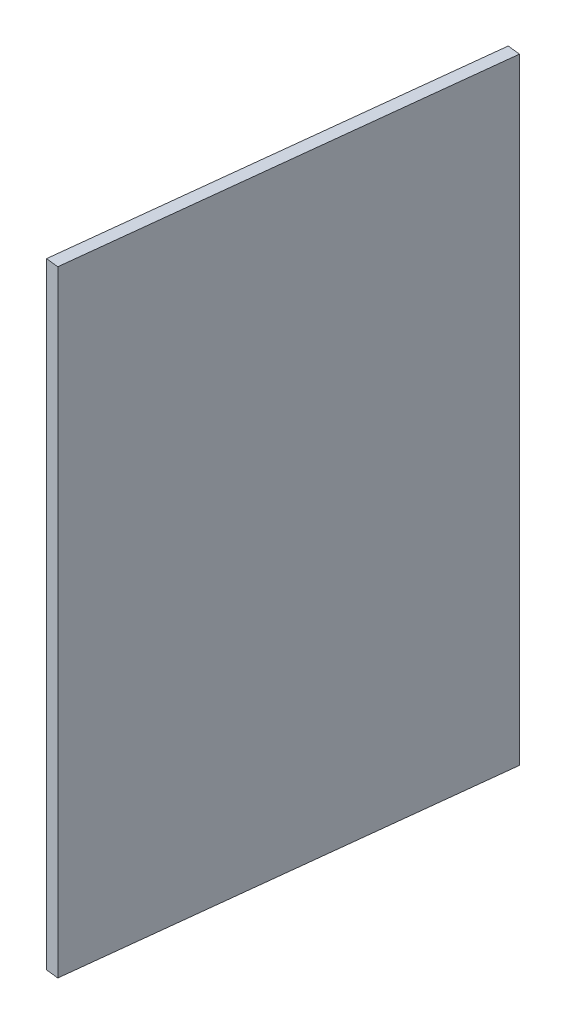
ISO-10303-21;
HEADER;
FILE_DESCRIPTION(('STEP AP214'),'2;1');
FILE_NAME('part.step','',(''),(''),'','','');
FILE_SCHEMA(('AUTOMOTIVE_DESIGN { 1 0 10303 214 1 1 1 1 }'));
ENDSEC;
DATA;
#1=APPLICATION_CONTEXT('core data for automotive mechanical design processes');
#2=APPLICATION_PROTOCOL_DEFINITION('international standard','automotive_design',2000,#1);
#3=PRODUCT_CONTEXT('',#1,'mechanical');
#4=PRODUCT('Part','Part','',(#3));
#5=PRODUCT_RELATED_PRODUCT_CATEGORY('part','',(#4));
#6=PRODUCT_DEFINITION_FORMATION('','',#4);
#7=PRODUCT_DEFINITION_CONTEXT('part definition',#1,'design');
#8=PRODUCT_DEFINITION('design','',#6,#7);
#9=PRODUCT_DEFINITION_SHAPE('','',#8);
#10=(LENGTH_UNIT() NAMED_UNIT(*) SI_UNIT(.MILLI.,.METRE.));
#11=(NAMED_UNIT(*) PLANE_ANGLE_UNIT() SI_UNIT($,.RADIAN.));
#12=(NAMED_UNIT(*) SI_UNIT($,.STERADIAN.) SOLID_ANGLE_UNIT());
#13=UNCERTAINTY_MEASURE_WITH_UNIT(LENGTH_MEASURE(1.E-05),#10,'distance_accuracy_value','');
#14=(GEOMETRIC_REPRESENTATION_CONTEXT(3) GLOBAL_UNCERTAINTY_ASSIGNED_CONTEXT((#13)) GLOBAL_UNIT_ASSIGNED_CONTEXT((#10,
#11,#12)) REPRESENTATION_CONTEXT('',''));
#15=CARTESIAN_POINT('',(0.,0.,0.));
#16=DIRECTION('',(0.,0.,1.));
#17=DIRECTION('',(1.,0.,0.));
#18=AXIS2_PLACEMENT_3D('',#15,#16,#17);
#19=CARTESIAN_POINT('',(8.87442397833839,0.,67.6658333209263));
#20=DIRECTION('',(-0.993723873054748,0.,-0.111860914179488));
#21=DIRECTION('',(-0.111860914179488,0.,0.993723873054748));
#22=AXIS2_PLACEMENT_3D('',#19,#20,#21);
#23=PLANE('',#22);
#24=DIRECTION('',(0.,1.,0.));
#25=VECTOR('',#24,1.);
#26=CARTESIAN_POINT('',(7.47616255109471,-18.4375000000002,80.0873817341106));
#27=LINE('',#26,#25);
#28=CARTESIAN_POINT('',(7.47616255109476,18.4375000000001,80.0873817341105));
#29=VERTEX_POINT('',#28);
#30=CARTESIAN_POINT('',(7.47616255109476,-18.4375000000002,80.0873817341105));
#31=VERTEX_POINT('',#30);
#32=EDGE_CURVE('E58',#29,#31,#27,.F.);
#33=ORIENTED_EDGE('',*,*,#32,.F.);
#34=DIRECTION('',(-0.11186091417949,0.,0.993723873054748));
#35=VECTOR('',#34,1.);
#36=CARTESIAN_POINT('',(10.272685405582,18.4375000000001,55.2442849077418));
#37=LINE('',#36,#35);
#38=CARTESIAN_POINT('',(10.272685405582,18.4375000000001,55.2442849077418));
#39=VERTEX_POINT('',#38);
#40=EDGE_CURVE('E53',#39,#29,#37,.T.);
#41=ORIENTED_EDGE('',*,*,#40,.F.);
#42=DIRECTION('',(0.,1.,0.));
#43=VECTOR('',#42,1.);
#44=CARTESIAN_POINT('',(10.272685405582,18.4375000000001,55.2442849077417));
#45=LINE('',#44,#43);
#46=CARTESIAN_POINT('',(10.272685405582,-18.4375000000002,55.2442849077418));
#47=VERTEX_POINT('',#46);
#48=EDGE_CURVE('E68',#47,#39,#45,.T.);
#49=ORIENTED_EDGE('',*,*,#48,.F.);
#50=DIRECTION('',(0.11186091417949,0.,-0.993723873054748));
#51=VECTOR('',#50,1.);
#52=CARTESIAN_POINT('',(7.47616255109473,-18.4375000000002,80.0873817341105));
#53=LINE('',#52,#51);
#54=EDGE_CURVE('E20',#31,#47,#53,.T.);
#55=ORIENTED_EDGE('',*,*,#54,.F.);
#56=EDGE_LOOP('',(#33,#41,#49,#55));
#57=FACE_BOUND('',#56,.T.);
#58=ADVANCED_FACE('F17',(#57),#23,.T.);
#59=CARTESIAN_POINT('',(11.0299029968497,-18.4375000000002,55.3295229243465));
#60=DIRECTION('',(0.,-1.,0.));
#61=DIRECTION('',(0.,0.,-1.));
#62=AXIS2_PLACEMENT_3D('',#59,#60,#61);
#63=PLANE('',#62);
#64=ORIENTED_EDGE('',*,*,#54,.T.);
#65=DIRECTION('',(-0.993723873054748,0.,-0.111860914179488));
#66=VECTOR('',#65,1.);
#67=CARTESIAN_POINT('',(11.0299029968497,-18.4375000000002,55.3295229243465));
#68=LINE('',#67,#66);
#69=CARTESIAN_POINT('',(11.0299029968497,-18.4375000000002,55.3295229243465));
#70=VERTEX_POINT('',#69);
#71=EDGE_CURVE('E79',#70,#47,#68,.T.);
#72=ORIENTED_EDGE('',*,*,#71,.F.);
#73=DIRECTION('',(-0.111860914179491,0.,0.993723873054748));
#74=VECTOR('',#73,1.);
#75=CARTESIAN_POINT('',(9.63164156960607,-18.4375000000002,67.7510713375309));
#76=LINE('',#75,#74);
#77=CARTESIAN_POINT('',(8.23338014236243,-18.4375000000002,80.1726197507154));
#78=VERTEX_POINT('',#77);
#79=EDGE_CURVE('E74',#70,#78,#76,.T.);
#80=ORIENTED_EDGE('',*,*,#79,.T.);
#81=DIRECTION('',(0.993723873054748,0.,0.111860914179488));
#82=VECTOR('',#81,1.);
#83=CARTESIAN_POINT('',(8.23338014236243,-18.4375000000002,80.1726197507154));
#84=LINE('',#83,#82);
#85=EDGE_CURVE('E63',#31,#78,#84,.T.);
#86=ORIENTED_EDGE('',*,*,#85,.F.);
#87=EDGE_LOOP('',(#64,#72,#80,#86));
#88=FACE_BOUND('',#87,.T.);
#89=ADVANCED_FACE('F73',(#88),#63,.T.);
#90=CARTESIAN_POINT('',(8.23338014236243,-18.4375000000002,80.1726197507154));
#91=DIRECTION('',(-0.111860914179488,0.,0.993723873054748));
#92=DIRECTION('',(0.993723873054748,0.,0.111860914179488));
#93=AXIS2_PLACEMENT_3D('',#90,#91,#92);
#94=PLANE('',#93);
#95=ORIENTED_EDGE('',*,*,#32,.T.);
#96=ORIENTED_EDGE('',*,*,#85,.T.);
#97=DIRECTION('',(0.,1.,0.));
#98=VECTOR('',#97,1.);
#99=CARTESIAN_POINT('',(8.23338014236242,0.,80.1726197507154));
#100=LINE('',#99,#98);
#101=CARTESIAN_POINT('',(8.23338014236243,18.4375000000001,80.1726197507154));
#102=VERTEX_POINT('',#101);
#103=EDGE_CURVE('E84',#78,#102,#100,.T.);
#104=ORIENTED_EDGE('',*,*,#103,.T.);
#105=DIRECTION('',(0.993723873054729,0.,0.111860914179658));
#106=VECTOR('',#105,1.);
#107=CARTESIAN_POINT('',(7.47616255109473,18.4375000000001,80.0873817341105));
#108=LINE('',#107,#106);
#109=EDGE_CURVE('E65',#29,#102,#108,.T.);
#110=ORIENTED_EDGE('',*,*,#109,.F.);
#111=EDGE_LOOP('',(#95,#96,#104,#110));
#112=FACE_BOUND('',#111,.T.);
#113=ADVANCED_FACE('F60',(#112),#94,.T.);
#114=CARTESIAN_POINT('',(8.23338014236243,18.4375000000001,80.1726197507154));
#115=DIRECTION('',(0.,1.,0.));
#116=DIRECTION('',(0.,0.,1.));
#117=AXIS2_PLACEMENT_3D('',#114,#115,#116);
#118=PLANE('',#117);
#119=ORIENTED_EDGE('',*,*,#40,.T.);
#120=ORIENTED_EDGE('',*,*,#109,.T.);
#121=DIRECTION('',(-0.111860914179491,0.,0.993723873054748));
#122=VECTOR('',#121,1.);
#123=CARTESIAN_POINT('',(9.63164156960607,18.4375000000001,67.7510713375309));
#124=LINE('',#123,#122);
#125=CARTESIAN_POINT('',(11.0299029968497,18.4375000000001,55.3295229243465));
#126=VERTEX_POINT('',#125);
#127=EDGE_CURVE('E26',#102,#126,#124,.F.);
#128=ORIENTED_EDGE('',*,*,#127,.T.);
#129=DIRECTION('',(-0.993723873054748,0.,-0.111860914179488));
#130=VECTOR('',#129,1.);
#131=CARTESIAN_POINT('',(11.0299029968497,18.4375000000001,55.3295229243465));
#132=LINE('',#131,#130);
#133=EDGE_CURVE('E34',#39,#126,#132,.F.);
#134=ORIENTED_EDGE('',*,*,#133,.F.);
#135=EDGE_LOOP('',(#119,#120,#128,#134));
#136=FACE_BOUND('',#135,.T.);
#137=ADVANCED_FACE('F88',(#136),#118,.T.);
#138=CARTESIAN_POINT('',(11.0299029968497,18.4375000000001,55.3295229243465));
#139=DIRECTION('',(0.111860914179488,0.,-0.993723873054748));
#140=DIRECTION('',(-0.993723873054748,0.,-0.111860914179488));
#141=AXIS2_PLACEMENT_3D('',#138,#139,#140);
#142=PLANE('',#141);
#143=ORIENTED_EDGE('',*,*,#48,.T.);
#144=ORIENTED_EDGE('',*,*,#133,.T.);
#145=DIRECTION('',(0.,1.,0.));
#146=VECTOR('',#145,1.);
#147=CARTESIAN_POINT('',(11.0299029968497,0.,55.3295229243465));
#148=LINE('',#147,#146);
#149=EDGE_CURVE('E11',#126,#70,#148,.F.);
#150=ORIENTED_EDGE('',*,*,#149,.T.);
#151=ORIENTED_EDGE('',*,*,#71,.T.);
#152=EDGE_LOOP('',(#143,#144,#150,#151));
#153=FACE_BOUND('',#152,.T.);
#154=ADVANCED_FACE('F91',(#153),#142,.T.);
#155=CARTESIAN_POINT('',(9.63164156960607,0.,67.7510713375309));
#156=DIRECTION('',(-0.993723873054748,0.,-0.111860914179491));
#157=DIRECTION('',(-0.111860914179491,0.,0.993723873054748));
#158=AXIS2_PLACEMENT_3D('',#155,#156,#157);
#159=PLANE('',#158);
#160=ORIENTED_EDGE('',*,*,#127,.F.);
#161=ORIENTED_EDGE('',*,*,#103,.F.);
#162=ORIENTED_EDGE('',*,*,#79,.F.);
#163=ORIENTED_EDGE('',*,*,#149,.F.);
#164=EDGE_LOOP('',(#160,#161,#162,#163));
#165=FACE_BOUND('',#164,.T.);
#166=ADVANCED_FACE('F90',(#165),#159,.F.);
#167=CLOSED_SHELL('',(#58,#89,#113,#137,#154,#166));
#168=MANIFOLD_SOLID_BREP('B1',#167);
#169=ADVANCED_BREP_SHAPE_REPRESENTATION('',(#18,#168),#14);
#170=SHAPE_DEFINITION_REPRESENTATION(#9,#169);
ENDSEC;
END-ISO-10303-21;
